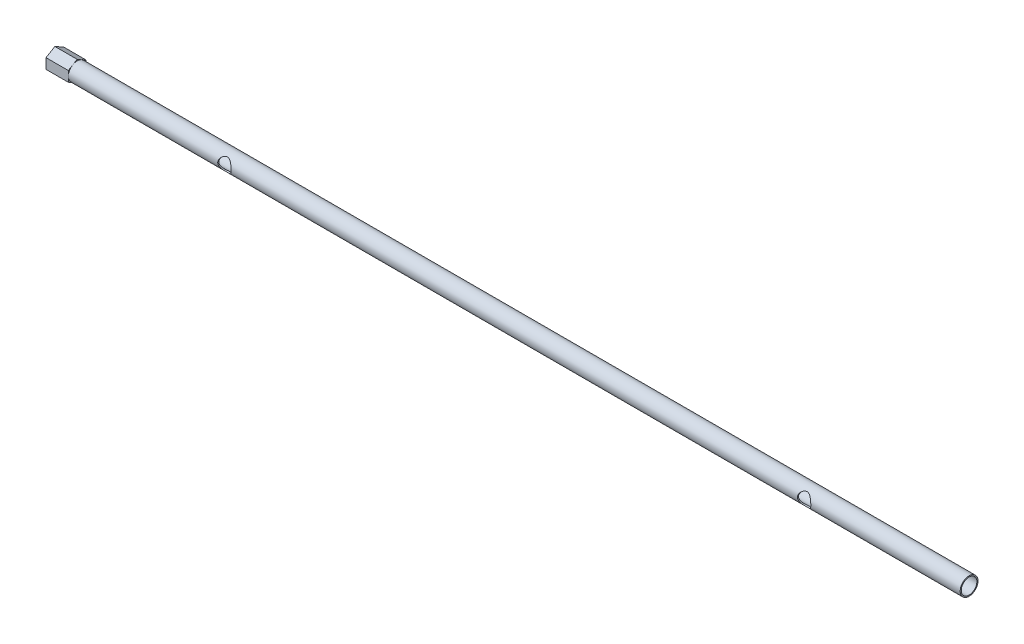
ISO-10303-21;
HEADER;
FILE_DESCRIPTION(('STEP AP214'),'2;1');
FILE_NAME('part.step','',(''),(''),'','','');
FILE_SCHEMA(('AUTOMOTIVE_DESIGN { 1 0 10303 214 1 1 1 1 }'));
ENDSEC;
DATA;
#1=APPLICATION_CONTEXT('core data for automotive mechanical design processes');
#2=APPLICATION_PROTOCOL_DEFINITION('international standard','automotive_design',2000,#1);
#3=PRODUCT_CONTEXT('',#1,'mechanical');
#4=PRODUCT('Part','Part','',(#3));
#5=PRODUCT_RELATED_PRODUCT_CATEGORY('part','',(#4));
#6=PRODUCT_DEFINITION_FORMATION('','',#4);
#7=PRODUCT_DEFINITION_CONTEXT('part definition',#1,'design');
#8=PRODUCT_DEFINITION('design','',#6,#7);
#9=PRODUCT_DEFINITION_SHAPE('','',#8);
#10=(LENGTH_UNIT() NAMED_UNIT(*) SI_UNIT(.MILLI.,.METRE.));
#11=(NAMED_UNIT(*) PLANE_ANGLE_UNIT() SI_UNIT($,.RADIAN.));
#12=(NAMED_UNIT(*) SI_UNIT($,.STERADIAN.) SOLID_ANGLE_UNIT());
#13=UNCERTAINTY_MEASURE_WITH_UNIT(LENGTH_MEASURE(1.E-05),#10,'distance_accuracy_value','');
#14=(GEOMETRIC_REPRESENTATION_CONTEXT(3) GLOBAL_UNCERTAINTY_ASSIGNED_CONTEXT((#13)) GLOBAL_UNIT_ASSIGNED_CONTEXT((#10,
#11,#12)) REPRESENTATION_CONTEXT('',''));
#15=CARTESIAN_POINT('',(0.,0.,0.));
#16=DIRECTION('',(0.,0.,1.));
#17=DIRECTION('',(1.,0.,0.));
#18=AXIS2_PLACEMENT_3D('',#15,#16,#17);
#19=CARTESIAN_POINT('',(100.,0.,0.));
#20=DIRECTION('',(1.,0.,0.));
#21=DIRECTION('',(0.,0.,-1.));
#22=AXIS2_PLACEMENT_3D('',#19,#20,#21);
#23=PLANE('',#22);
#24=CARTESIAN_POINT('',(100.,0.,0.));
#25=DIRECTION('',(1.,0.,0.));
#26=DIRECTION('',(0.,0.,-1.));
#27=AXIS2_PLACEMENT_3D('',#24,#25,#26);
#28=CIRCLE('',#27,1.75);
#29=CARTESIAN_POINT('',(100.,0.,-1.75000000000002));
#30=VERTEX_POINT('',#29);
#31=EDGE_CURVE('E279',#30,#30,#28,.T.);
#32=ORIENTED_EDGE('',*,*,#31,.F.);
#33=EDGE_LOOP('',(#32));
#34=FACE_BOUND('',#33,.T.);
#35=CARTESIAN_POINT('',(100.,0.,0.));
#36=DIRECTION('',(1.,0.,0.));
#37=DIRECTION('',(0.,0.,-1.));
#38=AXIS2_PLACEMENT_3D('',#35,#36,#37);
#39=CIRCLE('',#38,2.);
#40=CARTESIAN_POINT('',(100.,0.,-2.00000000000004));
#41=VERTEX_POINT('',#40);
#42=EDGE_CURVE('E12',#41,#41,#39,.T.);
#43=ORIENTED_EDGE('',*,*,#42,.T.);
#44=EDGE_LOOP('',(#43));
#45=FACE_BOUND('',#44,.T.);
#46=ADVANCED_FACE('F49',(#34,#45),#23,.T.);
#47=CARTESIAN_POINT('',(-100.,0.,0.));
#48=DIRECTION('',(1.,0.,0.));
#49=DIRECTION('',(0.,0.,-1.));
#50=AXIS2_PLACEMENT_3D('',#47,#48,#49);
#51=CYLINDRICAL_SURFACE('',#50,2.);
#52=CARTESIAN_POINT('',(66.5,0.,2.));
#53=CARTESIAN_POINT('',(66.499995207988,0.0732207358411531,1.99999540196398));
#54=CARTESIAN_POINT('',(66.4945949756255,0.146561062021482,1.99593645526273));
#55=CARTESIAN_POINT('',(66.4733329365898,0.290936396286464,1.98006607281078));
#56=CARTESIAN_POINT('',(66.4574448283499,0.361965136229003,1.9682351467985));
#57=CARTESIAN_POINT('',(66.4162870907162,0.49923462663125,1.93795674956057));
#58=CARTESIAN_POINT('',(66.3910744864308,0.565501615403738,1.91954951932006));
#59=CARTESIAN_POINT('',(66.3324576558128,0.692422335520754,1.8775055672169));
#60=CARTESIAN_POINT('',(66.2990558258065,0.753077701796332,1.8538703753548));
#61=CARTESIAN_POINT('',(66.2217369884092,0.873465937590141,1.8004954454398));
#62=CARTESIAN_POINT('',(66.1771326706659,0.932593229272026,1.77039308548437));
#63=CARTESIAN_POINT('',(66.0805041626388,1.0430271676767,1.70767017883375));
#64=CARTESIAN_POINT('',(66.0284685172002,1.09432148272226,1.67504578078606));
#65=CARTESIAN_POINT('',(65.9064170467216,1.19837161436623,1.60271123651987));
#66=CARTESIAN_POINT('',(65.8348963228783,1.24930578421204,1.56290854864636));
#67=CARTESIAN_POINT('',(65.6825489876335,1.33861998176348,1.48711444664132));
#68=CARTESIAN_POINT('',(65.6017353029997,1.37701716983077,1.45111786883673));
#69=CARTESIAN_POINT('',(65.4604971613238,1.42880627811788,1.39977155180176));
#70=CARTESIAN_POINT('',(65.4026093028716,1.44625674456538,1.38157751186731));
#71=CARTESIAN_POINT('',(65.2836072652151,1.47420672564843,1.35171594150683));
#72=CARTESIAN_POINT('',(65.2225008221252,1.48472215355267,1.34003347910829));
#73=CARTESIAN_POINT('',(65.0978174144692,1.49812822141445,1.3250375968455));
#74=CARTESIAN_POINT('',(65.034223193276,1.50094954854207,1.32180026676594));
#75=CARTESIAN_POINT('',(64.9073850891184,1.49848213241868,1.32459531776065));
#76=CARTESIAN_POINT('',(64.8441413399126,1.49319048157349,1.3306310221811));
#77=CARTESIAN_POINT('',(64.7268086525742,1.47597739291882,1.34967623262516));
#78=CARTESIAN_POINT('',(64.6724636289538,1.46482486380817,1.36187157059868));
#79=CARTESIAN_POINT('',(64.5665611212792,1.43705671120733,1.39114192844935));
#80=CARTESIAN_POINT('',(64.5150063721764,1.42043583681173,1.40822163640765));
#81=CARTESIAN_POINT('',(64.3837436133659,1.37033064172535,1.45741769294302));
#82=CARTESIAN_POINT('',(64.3065995833565,1.33280148493981,1.49225649139229));
#83=CARTESIAN_POINT('',(64.1608034761309,1.2461802331452,1.56533298145192));
#84=CARTESIAN_POINT('',(64.0921726607454,1.1970600425588,1.60357878886105));
#85=CARTESIAN_POINT('',(63.9622466095964,1.08651604102137,1.68051672313141));
#86=CARTESIAN_POINT('',(63.9011793931185,1.02481375526039,1.71919586730235));
#87=CARTESIAN_POINT('',(63.7897363532189,0.890422521709622,1.79248037980968));
#88=CARTESIAN_POINT('',(63.7393400797697,0.817755054293794,1.82709348263755));
#89=CARTESIAN_POINT('',(63.6600192007597,0.677902080454187,1.88279726073639));
#90=CARTESIAN_POINT('',(63.6288154057842,0.612539870185665,1.90520770945004));
#91=CARTESIAN_POINT('',(63.5757751195362,0.476352173202131,1.94372904416944));
#92=CARTESIAN_POINT('',(63.5539327615007,0.40553014106381,1.95984387504348));
#93=CARTESIAN_POINT('',(63.5207466371136,0.259676232483561,1.98445588635986));
#94=CARTESIAN_POINT('',(63.5094678210614,0.184621281405985,1.99290592971746));
#95=CARTESIAN_POINT('',(63.4984504026283,0.0332012397969592,2.00115883659442));
#96=CARTESIAN_POINT('',(63.4987069313046,-0.043163284372682,2.00096534845405));
#97=CARTESIAN_POINT('',(63.5101108692732,-0.186804217329586,1.99242547175871));
#98=CARTESIAN_POINT('',(63.5201605368887,-0.254222327546095,1.98490086600399));
#99=CARTESIAN_POINT('',(63.5489737800079,-0.386110670609081,1.96351320201585));
#100=CARTESIAN_POINT('',(63.5677392096894,-0.450580272987225,1.9496487950726));
#101=CARTESIAN_POINT('',(63.6138875305931,-0.577416779689736,1.91599830683311));
#102=CARTESIAN_POINT('',(63.6415511814274,-0.639629172536109,1.89602050290191));
#103=CARTESIAN_POINT('',(63.7041724554256,-0.758518527043045,1.85166985411961));
#104=CARTESIAN_POINT('',(63.7391310876397,-0.815194721336375,1.82729640132066));
#105=CARTESIAN_POINT('',(63.8217832464106,-0.931511626319005,1.77119146886498));
#106=CARTESIAN_POINT('',(63.8706285394374,-0.990066762698668,1.73891095025036));
#107=CARTESIAN_POINT('',(63.9760087525884,-1.0987197485585,1.67238952874784));
#108=CARTESIAN_POINT('',(64.0325606996933,-1.14879830469573,1.63814438507394));
#109=CARTESIAN_POINT('',(64.1641498809611,-1.24877541075623,1.56369128291496));
#110=CARTESIAN_POINT('',(64.2406575614923,-1.29683043648702,1.523587185201));
#111=CARTESIAN_POINT('',(64.4033600779724,-1.3792323599828,1.4494059134845));
#112=CARTESIAN_POINT('',(64.4895251219085,-1.41362000515517,1.41531099570968));
#113=CARTESIAN_POINT('',(64.6354144488744,-1.45615734256766,1.37118877808581));
#114=CARTESIAN_POINT('',(64.6923911264023,-1.46931009512994,1.35695811824563));
#115=CARTESIAN_POINT('',(64.8087070469831,-1.48891522181905,1.33542056103009));
#116=CARTESIAN_POINT('',(64.8680407068022,-1.49538255199239,1.32809821220231));
#117=CARTESIAN_POINT('',(64.9878290798113,-1.50115320209064,1.32157601792206));
#118=CARTESIAN_POINT('',(65.0482879430095,-1.50042015325262,1.32241740684972));
#119=CARTESIAN_POINT('',(65.1680568387521,-1.49176883838219,1.33216448543663));
#120=CARTESIAN_POINT('',(65.2273652878972,-1.48384130024585,1.3410805815748));
#121=CARTESIAN_POINT('',(65.3559145714108,-1.45893841819724,1.36817348797769));
#122=CARTESIAN_POINT('',(65.4244971801327,-1.44036567954113,1.38794705950639));
#123=CARTESIAN_POINT('',(65.5565348488304,-1.39469627266121,1.43382963385405));
#124=CARTESIAN_POINT('',(65.6199764420381,-1.36757807297733,1.45995460146924));
#125=CARTESIAN_POINT('',(65.7625206304863,-1.29498918933646,1.52516477328817));
#126=CARTESIAN_POINT('',(65.8394215827557,-1.24641542065974,1.56560203191098));
#127=CARTESIAN_POINT('',(65.9831260449775,-1.13650718465942,1.64713510181266));
#128=CARTESIAN_POINT('',(66.0499204659448,-1.07516134758583,1.68823146954215));
#129=CARTESIAN_POINT('',(66.1728318422833,-0.939627144937967,1.76728988939786));
#130=CARTESIAN_POINT('',(66.2288563193771,-0.86533716156294,1.80522333711065));
#131=CARTESIAN_POINT('',(66.3272230511453,-0.705159098936293,1.8735728966809));
#132=CARTESIAN_POINT('',(66.3695979745725,-0.619299420401887,1.90400691592953));
#133=CARTESIAN_POINT('',(66.4277994209857,-0.464840290356554,1.94636704624042));
#134=CARTESIAN_POINT('',(66.4477667313761,-0.398553614774835,1.96110322499713));
#135=CARTESIAN_POINT('',(66.4784179026115,-0.262841610392866,1.98383739970233));
#136=CARTESIAN_POINT('',(66.4891276902499,-0.193425623835011,1.99185421210891));
#137=CARTESIAN_POINT('',(66.4966046942143,-0.102963309861976,1.99745471706305));
#138=CARTESIAN_POINT('',(66.4978762774894,-0.0824069459941934,1.99840761432076));
#139=CARTESIAN_POINT('',(66.499574673231,-0.041236889624413,1.99968095423136));
#140=CARTESIAN_POINT('',(66.5000013497074,-0.0206231884284055,2.00000129507252));
#141=CARTESIAN_POINT('',(66.5,0.,2.));
#142=B_SPLINE_CURVE_WITH_KNOTS('',3,(#52,#53,#54,#55,#56,#57,#58,#59,#60,#61,#62,#63,#64,#65,
#66,#67,#68,#69,#70,#71,#72,#73,#74,#75,#76,#77,#78,#79,#80,#81,#82,#83,#84,#85,#86,#87,#88,#89,
#90,#91,#92,#93,#94,#95,#96,#97,#98,#99,#100,#101,#102,#103,#104,#105,#106,#107,#108,#109,#110,
#111,#112,#113,#114,#115,#116,#117,#118,#119,#120,#121,#122,#123,#124,#125,#126,#127,#128,#129,
#130,#131,#132,#133,#134,#135,#136,#137,#138,#139,#140,#141),.UNSPECIFIED.,.T.,.F.,(4,2,2,2,2,2,
2,2,2,2,2,2,2,2,2,2,2,2,2,2,2,2,2,2,2,2,2,2,2,2,2,2,2,2,2,2,2,2,2,2,2,2,2,2,4),(0.,
0.21957178657204,0.439696319423245,0.65849633357339,0.877232398849294,1.11622431317429,
1.35558868405162,1.64360015887451,1.93121574056506,2.11999518529899,2.30833993195288,
2.49837587621255,2.68847994300207,2.85826890162705,3.02822137600637,3.30449331805907,
3.58144192357885,3.86535883938086,4.14872662493685,4.37526505006383,4.60166129643112,
4.82944058166894,5.05712372466609,5.26191187011989,5.46674360185808,5.67880439483675,
5.89089453977537,6.13840382081862,6.38646908985446,6.68168596015939,6.97601595850105,
7.15589161422927,7.33536399114202,7.51574333854736,7.69635548563848,7.91639670960126,
8.13699685139911,8.43412246655758,8.73151372390882,9.03135449492637,9.33047220273152,
9.54195697541617,9.75284752283244,9.81468166878704,9.87652576630964),.UNSPECIFIED.);
#143=CARTESIAN_POINT('',(66.5,0.,2.));
#144=VERTEX_POINT('',#143);
#145=EDGE_CURVE('E271',#144,#144,#142,.T.);
#146=ORIENTED_EDGE('',*,*,#145,.F.);
#147=EDGE_LOOP('',(#146));
#148=FACE_BOUND('',#147,.T.);
#149=CARTESIAN_POINT('',(-63.5,0.,2.));
#150=CARTESIAN_POINT('',(-63.500004792012,0.0732207358411538,1.99999540196396));
#151=CARTESIAN_POINT('',(-63.5054050243745,0.146561062021485,1.99593645526274));
#152=CARTESIAN_POINT('',(-63.5266670634102,0.290936396286466,1.98006607281082));
#153=CARTESIAN_POINT('',(-63.5425551716501,0.361965136229003,1.96823514679853));
#154=CARTESIAN_POINT('',(-63.5837129092838,0.49923462663125,1.9379567495606));
#155=CARTESIAN_POINT('',(-63.6089255135692,0.565501615403739,1.91954951932008));
#156=CARTESIAN_POINT('',(-63.6675423441872,0.692422335520755,1.87750556721693));
#157=CARTESIAN_POINT('',(-63.7009441741935,0.753077701796334,1.85387037535483));
#158=CARTESIAN_POINT('',(-63.7782630115908,0.873465937590145,1.80049544543982));
#159=CARTESIAN_POINT('',(-63.8228673293341,0.932593229272033,1.77039308548439));
#160=CARTESIAN_POINT('',(-63.9194958373611,1.04302716767671,1.70767017883377));
#161=CARTESIAN_POINT('',(-63.9715314827998,1.09432148272226,1.67504578078608));
#162=CARTESIAN_POINT('',(-64.0935829532783,1.19837161436624,1.60271123651989));
#163=CARTESIAN_POINT('',(-64.1651036771217,1.24930578421205,1.56290854864638));
#164=CARTESIAN_POINT('',(-64.3174510123665,1.33861998176349,1.48711444664133));
#165=CARTESIAN_POINT('',(-64.3982646970003,1.37701716983078,1.45111786883673));
#166=CARTESIAN_POINT('',(-64.5395028386762,1.4288062781179,1.39977155180176));
#167=CARTESIAN_POINT('',(-64.5973906971283,1.44625674456541,1.38157751186731));
#168=CARTESIAN_POINT('',(-64.7163927347849,1.47420672564846,1.35171594150683));
#169=CARTESIAN_POINT('',(-64.7774991778747,1.48472215355269,1.34003347910829));
#170=CARTESIAN_POINT('',(-64.9021825855307,1.49812822141448,1.32503759684549));
#171=CARTESIAN_POINT('',(-64.965776806724,1.50094954854209,1.32180026676594));
#172=CARTESIAN_POINT('',(-65.0926149108815,1.49848213241871,1.32459531776064));
#173=CARTESIAN_POINT('',(-65.1558586600874,1.49319048157352,1.33063102218109));
#174=CARTESIAN_POINT('',(-65.2731913474258,1.47597739291885,1.34967623262515));
#175=CARTESIAN_POINT('',(-65.3275363710461,1.4648248638082,1.36187157059866));
#176=CARTESIAN_POINT('',(-65.4334388787208,1.43705671120737,1.39114192844934));
#177=CARTESIAN_POINT('',(-65.4849936278235,1.42043583681177,1.40822163640764));
#178=CARTESIAN_POINT('',(-65.6162563866341,1.37033064172539,1.45741769294301));
#179=CARTESIAN_POINT('',(-65.6934004166435,1.33280148493985,1.49225649139227));
#180=CARTESIAN_POINT('',(-65.839196523869,1.24618023314525,1.56533298145191));
#181=CARTESIAN_POINT('',(-65.9078273392546,1.19706004255885,1.60357878886104));
#182=CARTESIAN_POINT('',(-66.0377533904036,1.08651604102143,1.6805167231314));
#183=CARTESIAN_POINT('',(-66.0988206068814,1.02481375526044,1.71919586730234));
#184=CARTESIAN_POINT('',(-66.2102636467811,0.890422521709677,1.79248037980967));
#185=CARTESIAN_POINT('',(-66.2606599202303,0.81775505429385,1.82709348263755));
#186=CARTESIAN_POINT('',(-66.3399807992403,0.677902080454242,1.88279726073639));
#187=CARTESIAN_POINT('',(-66.3711845942157,0.612539870185719,1.90520770945004));
#188=CARTESIAN_POINT('',(-66.4242248804638,0.476352173202188,1.94372904416945));
#189=CARTESIAN_POINT('',(-66.4460672384993,0.405530141063871,1.95984387504349));
#190=CARTESIAN_POINT('',(-66.4792533628864,0.259676232483624,1.98445588635987));
#191=CARTESIAN_POINT('',(-66.4905321789386,0.184621281406046,1.99290592971748));
#192=CARTESIAN_POINT('',(-66.5015495973717,0.0332012397970168,2.00115883659444));
#193=CARTESIAN_POINT('',(-66.5012930686954,-0.0431632843726258,2.00096534845407));
#194=CARTESIAN_POINT('',(-66.4898891307268,-0.186804217329532,1.99242547175874));
#195=CARTESIAN_POINT('',(-66.4798394631113,-0.254222327546042,1.98490086600402));
#196=CARTESIAN_POINT('',(-66.4510262199921,-0.38611067060903,1.96351320201589));
#197=CARTESIAN_POINT('',(-66.4322607903106,-0.450580272987175,1.94964879507263));
#198=CARTESIAN_POINT('',(-66.3861124694069,-0.577416779689684,1.91599830683315));
#199=CARTESIAN_POINT('',(-66.3584488185726,-0.639629172536053,1.89602050290196));
#200=CARTESIAN_POINT('',(-66.2958275445744,-0.758518527042986,1.85166985411966));
#201=CARTESIAN_POINT('',(-66.2608689123603,-0.815194721336316,1.82729640132071));
#202=CARTESIAN_POINT('',(-66.1782167535895,-0.931511626318951,1.77119146886503));
#203=CARTESIAN_POINT('',(-66.1293714605626,-0.990066762698618,1.73891095025041));
#204=CARTESIAN_POINT('',(-66.0239912474117,-1.09871974855846,1.67238952874789));
#205=CARTESIAN_POINT('',(-65.9674393003067,-1.14879830469569,1.638144385074));
#206=CARTESIAN_POINT('',(-65.8358501190389,-1.24877541075619,1.56369128291502));
#207=CARTESIAN_POINT('',(-65.7593424385078,-1.29683043648697,1.52358718520106));
#208=CARTESIAN_POINT('',(-65.5966399220276,-1.37923235998276,1.44940591348456));
#209=CARTESIAN_POINT('',(-65.5104748780915,-1.41362000515513,1.41531099570975));
#210=CARTESIAN_POINT('',(-65.3645855511256,-1.45615734256762,1.37118877808588));
#211=CARTESIAN_POINT('',(-65.3076088735977,-1.46931009512991,1.35695811824569));
#212=CARTESIAN_POINT('',(-65.1912929530169,-1.48891522181902,1.33542056103015));
#213=CARTESIAN_POINT('',(-65.1319592931978,-1.49538255199236,1.32809821220237));
#214=CARTESIAN_POINT('',(-65.0121709201888,-1.50115320209061,1.32157601792211));
#215=CARTESIAN_POINT('',(-64.9517120569905,-1.50042015325259,1.32241740684978));
#216=CARTESIAN_POINT('',(-64.8319431612479,-1.49176883838217,1.33216448543668));
#217=CARTESIAN_POINT('',(-64.7726347121028,-1.48384130024582,1.34108058157485));
#218=CARTESIAN_POINT('',(-64.6440854285893,-1.45893841819721,1.36817348797774));
#219=CARTESIAN_POINT('',(-64.5755028198673,-1.4403656795411,1.38794705950644));
#220=CARTESIAN_POINT('',(-64.4434651511696,-1.39469627266119,1.43382963385409));
#221=CARTESIAN_POINT('',(-64.3800235579619,-1.3675780729773,1.45995460146928));
#222=CARTESIAN_POINT('',(-64.2374793695138,-1.29498918933645,1.52516477328821));
#223=CARTESIAN_POINT('',(-64.1605784172444,-1.24641542065973,1.56560203191102));
#224=CARTESIAN_POINT('',(-64.0168739550225,-1.13650718465941,1.64713510181269));
#225=CARTESIAN_POINT('',(-63.9500795340552,-1.07516134758582,1.68823146954219));
#226=CARTESIAN_POINT('',(-63.8271681577167,-0.939627144937955,1.76728988939789));
#227=CARTESIAN_POINT('',(-63.7711436806229,-0.86533716156293,1.80522333711068));
#228=CARTESIAN_POINT('',(-63.6727769488547,-0.705159098936286,1.87357289668093));
#229=CARTESIAN_POINT('',(-63.6304020254276,-0.619299420401884,1.90400691592955));
#230=CARTESIAN_POINT('',(-63.5722005790143,-0.464840290356556,1.94636704624045));
#231=CARTESIAN_POINT('',(-63.5522332686239,-0.398553614774837,1.96110322499715));
#232=CARTESIAN_POINT('',(-63.5215820973885,-0.262841610392866,1.98383739970236));
#233=CARTESIAN_POINT('',(-63.5108723097501,-0.19342562383501,1.99185421210892));
#234=CARTESIAN_POINT('',(-63.5033953057857,-0.102963309861974,1.99745471706308));
#235=CARTESIAN_POINT('',(-63.5021237225106,-0.0824069459941915,1.99840761432079));
#236=CARTESIAN_POINT('',(-63.500425326769,-0.0412368896244121,1.99968095423138));
#237=CARTESIAN_POINT('',(-63.4999986502926,-0.0206231884284051,2.00000129507253));
#238=CARTESIAN_POINT('',(-63.5,0.,2.));
#239=B_SPLINE_CURVE_WITH_KNOTS('',3,(#149,#150,#151,#152,#153,#154,#155,#156,#157,#158,#159,
#160,#161,#162,#163,#164,#165,#166,#167,#168,#169,#170,#171,#172,#173,#174,#175,#176,#177,#178,
#179,#180,#181,#182,#183,#184,#185,#186,#187,#188,#189,#190,#191,#192,#193,#194,#195,#196,#197,
#198,#199,#200,#201,#202,#203,#204,#205,#206,#207,#208,#209,#210,#211,#212,#213,#214,#215,#216,
#217,#218,#219,#220,#221,#222,#223,#224,#225,#226,#227,#228,#229,#230,#231,#232,#233,#234,#235,
#236,#237,#238),.UNSPECIFIED.,.T.,.F.,(4,2,2,2,2,2,2,2,2,2,2,2,2,2,2,2,2,2,2,2,2,2,2,2,2,2,2,2,
2,2,2,2,2,2,2,2,2,2,2,2,2,2,2,2,4),(0.,0.219571786572042,0.439696319423244,0.658496333573383,
0.877232398849291,1.11622431317428,1.35558868405161,1.6436001588745,1.93121574056507,
2.11999518529901,2.30833993195289,2.49837587621255,2.68847994300209,2.85826890162705,
3.02822137600637,3.30449331805907,3.58144192357885,3.86535883938086,4.14872662493686,
4.37526505006385,4.60166129643113,4.82944058166895,5.0571237246661,5.26191187011991,
5.46674360185809,5.67880439483676,5.89089453977537,6.13840382081862,6.38646908985446,
6.68168596015939,6.97601595850104,7.15589161422926,7.33536399114202,7.51574333854735,
7.6963554856385,7.91639670960127,8.13699685139913,8.43412246655757,8.73151372390882,
9.03135449492638,9.33047220273151,9.54195697541617,9.75284752283244,9.81468166878703,
9.87652576630963),.UNSPECIFIED.);
#240=CARTESIAN_POINT('',(-63.5,0.,2.));
#241=VERTEX_POINT('',#240);
#242=EDGE_CURVE('E264',#241,#241,#239,.T.);
#243=ORIENTED_EDGE('',*,*,#242,.F.);
#244=EDGE_LOOP('',(#243));
#245=FACE_BOUND('',#244,.T.);
#246=ORIENTED_EDGE('',*,*,#42,.F.);
#247=EDGE_LOOP('',(#246));
#248=FACE_BOUND('',#247,.T.);
#249=CARTESIAN_POINT('',(-100.,0.,0.));
#250=DIRECTION('',(1.,0.,0.));
#251=DIRECTION('',(0.,0.,-1.));
#252=AXIS2_PLACEMENT_3D('',#249,#250,#251);
#253=CIRCLE('',#252,2.);
#254=CARTESIAN_POINT('',(-100.,0.0201471971774126,-1.99989852003691));
#255=VERTEX_POINT('',#254);
#256=CARTESIAN_POINT('',(-100.,1.74203652193158,-0.982501275447766));
#257=VERTEX_POINT('',#256);
#258=EDGE_CURVE('E57',#255,#257,#253,.T.);
#259=ORIENTED_EDGE('',*,*,#258,.T.);
#260=CARTESIAN_POINT('',(-100.,1.72188932475418,1.01739724458916));
#261=VERTEX_POINT('',#260);
#262=EDGE_CURVE('E162',#257,#261,#253,.T.);
#263=ORIENTED_EDGE('',*,*,#262,.T.);
#264=CARTESIAN_POINT('',(-100.,-0.0201471971774125,1.99989852003695));
#265=VERTEX_POINT('',#264);
#266=EDGE_CURVE('E167',#261,#265,#253,.T.);
#267=ORIENTED_EDGE('',*,*,#266,.T.);
#268=CARTESIAN_POINT('',(-100.,-1.7420365219316,0.982501275447775));
#269=VERTEX_POINT('',#268);
#270=EDGE_CURVE('E72',#265,#269,#253,.T.);
#271=ORIENTED_EDGE('',*,*,#270,.T.);
#272=CARTESIAN_POINT('',(-100.,-1.72188932475417,-1.01739724458915));
#273=VERTEX_POINT('',#272);
#274=EDGE_CURVE('E156',#269,#273,#253,.T.);
#275=ORIENTED_EDGE('',*,*,#274,.T.);
#276=EDGE_CURVE('E151',#273,#255,#253,.T.);
#277=ORIENTED_EDGE('',*,*,#276,.T.);
#278=EDGE_LOOP('',(#259,#263,#267,#271,#275,#277));
#279=FACE_BOUND('',#278,.T.);
#280=ADVANCED_FACE('F173',(#148,#245,#248,#279),#51,.T.);
#281=CARTESIAN_POINT('',(-100.,0.,0.));
#282=DIRECTION('',(-1.,0.,0.));
#283=DIRECTION('',(0.,0.,1.));
#284=AXIS2_PLACEMENT_3D('',#281,#282,#283);
#285=PLANE('',#284);
#286=ORIENTED_EDGE('',*,*,#258,.F.);
#287=DIRECTION('',(0.,-0.999949260018464,-0.0100735985887064));
#288=VECTOR('',#287,1.);
#289=CARTESIAN_POINT('',(-100.,1.17478914607267,-1.98826653032311));
#290=LINE('',#289,#288);
#291=CARTESIAN_POINT('',(-100.,1.17478914607267,-1.98826653032311));
#292=VERTEX_POINT('',#291);
#293=EDGE_CURVE('E64',#292,#255,#290,.T.);
#294=ORIENTED_EDGE('',*,*,#293,.F.);
#295=DIRECTION('',(0.,-0.491250637723885,-0.871018260965794));
#296=VECTOR('',#295,1.);
#297=CARTESIAN_POINT('',(-100.,2.30928389779051,0.0232639794276106));
#298=LINE('',#297,#296);
#299=EDGE_CURVE('E200',#257,#292,#298,.T.);
#300=ORIENTED_EDGE('',*,*,#299,.F.);
#301=EDGE_LOOP('',(#286,#294,#300));
#302=FACE_BOUND('',#301,.T.);
#303=ADVANCED_FACE('F233',(#302),#285,.F.);
#304=ORIENTED_EDGE('',*,*,#262,.F.);
#305=CARTESIAN_POINT('',(-100.,2.30928389779051,0.0232639794276106));
#306=VERTEX_POINT('',#305);
#307=EDGE_CURVE('E201',#306,#257,#298,.T.);
#308=ORIENTED_EDGE('',*,*,#307,.F.);
#309=DIRECTION('',(0.,0.508698622294579,-0.860944662377087));
#310=VECTOR('',#309,1.);
#311=CARTESIAN_POINT('',(-100.,1.13449475171784,2.01153050975074));
#312=LINE('',#311,#310);
#313=EDGE_CURVE('E195',#261,#306,#312,.T.);
#314=ORIENTED_EDGE('',*,*,#313,.F.);
#315=EDGE_LOOP('',(#304,#308,#314));
#316=FACE_BOUND('',#315,.T.);
#317=ADVANCED_FACE('F230',(#316),#285,.F.);
#318=ORIENTED_EDGE('',*,*,#266,.F.);
#319=CARTESIAN_POINT('',(-100.,1.13449475171784,2.01153050975074));
#320=VERTEX_POINT('',#319);
#321=EDGE_CURVE('E196',#320,#261,#312,.T.);
#322=ORIENTED_EDGE('',*,*,#321,.F.);
#323=DIRECTION('',(0.,0.999949260018464,0.0100735985887064));
#324=VECTOR('',#323,1.);
#325=CARTESIAN_POINT('',(-100.,-1.17478914607267,1.98826653032315));
#326=LINE('',#325,#324);
#327=EDGE_CURVE('E188',#265,#320,#326,.T.);
#328=ORIENTED_EDGE('',*,*,#327,.F.);
#329=EDGE_LOOP('',(#318,#322,#328));
#330=FACE_BOUND('',#329,.T.);
#331=ADVANCED_FACE('F240',(#330),#285,.F.);
#332=ORIENTED_EDGE('',*,*,#270,.F.);
#333=CARTESIAN_POINT('',(-100.,-1.17478914607267,1.98826653032315));
#334=VERTEX_POINT('',#333);
#335=EDGE_CURVE('E182',#334,#265,#326,.T.);
#336=ORIENTED_EDGE('',*,*,#335,.F.);
#337=DIRECTION('',(0.,0.491250637723885,0.871018260965794));
#338=VECTOR('',#337,1.);
#339=CARTESIAN_POINT('',(-100.,-2.30928389779051,-0.0232639794275722));
#340=LINE('',#339,#338);
#341=EDGE_CURVE('E149',#269,#334,#340,.T.);
#342=ORIENTED_EDGE('',*,*,#341,.F.);
#343=EDGE_LOOP('',(#332,#336,#342));
#344=FACE_BOUND('',#343,.T.);
#345=ADVANCED_FACE('F181',(#344),#285,.F.);
#346=ORIENTED_EDGE('',*,*,#274,.F.);
#347=CARTESIAN_POINT('',(-100.,-2.30928389779051,-0.0232639794275722));
#348=VERTEX_POINT('',#347);
#349=EDGE_CURVE('E178',#348,#269,#340,.T.);
#350=ORIENTED_EDGE('',*,*,#349,.F.);
#351=DIRECTION('',(0.,-0.508698622294579,0.860944662377088));
#352=VECTOR('',#351,1.);
#353=CARTESIAN_POINT('',(-100.,-1.13449475171784,-2.01153050975071));
#354=LINE('',#353,#352);
#355=EDGE_CURVE('E179',#273,#348,#354,.T.);
#356=ORIENTED_EDGE('',*,*,#355,.F.);
#357=EDGE_LOOP('',(#346,#350,#356));
#358=FACE_BOUND('',#357,.T.);
#359=ADVANCED_FACE('F177',(#358),#285,.F.);
#360=CARTESIAN_POINT('',(-105.,-2.30928389779051,-0.0232639794275713));
#361=DIRECTION('',(0.,0.871018260965794,-0.491250637723885));
#362=DIRECTION('',(0.,0.491250637723885,0.871018260965794));
#363=AXIS2_PLACEMENT_3D('',#360,#361,#362);
#364=PLANE('',#363);
#365=ORIENTED_EDGE('',*,*,#349,.T.);
#366=ORIENTED_EDGE('',*,*,#341,.T.);
#367=DIRECTION('',(1.,0.,0.));
#368=VECTOR('',#367,1.);
#369=CARTESIAN_POINT('',(-105.,-1.17478914607267,1.98826653032315));
#370=LINE('',#369,#368);
#371=CARTESIAN_POINT('',(-105.,-1.17478914607267,1.98826653032315));
#372=VERTEX_POINT('',#371);
#373=EDGE_CURVE('E128',#372,#334,#370,.T.);
#374=ORIENTED_EDGE('',*,*,#373,.F.);
#375=DIRECTION('',(0.,0.491250637723885,0.871018260965794));
#376=VECTOR('',#375,1.);
#377=CARTESIAN_POINT('',(-105.,-2.30928389779051,-0.0232639794275713));
#378=LINE('',#377,#376);
#379=CARTESIAN_POINT('',(-105.,-2.30928389779051,-0.0232639794275713));
#380=VERTEX_POINT('',#379);
#381=EDGE_CURVE('E135',#380,#372,#378,.T.);
#382=ORIENTED_EDGE('',*,*,#381,.F.);
#383=DIRECTION('',(1.,0.,0.));
#384=VECTOR('',#383,1.);
#385=CARTESIAN_POINT('',(-105.,-2.30928389779051,-0.0232639794275713));
#386=LINE('',#385,#384);
#387=EDGE_CURVE('E186',#380,#348,#386,.T.);
#388=ORIENTED_EDGE('',*,*,#387,.T.);
#389=EDGE_LOOP('',(#365,#366,#374,#382,#388));
#390=FACE_BOUND('',#389,.T.);
#391=ADVANCED_FACE('F148',(#390),#364,.F.);
#392=CARTESIAN_POINT('',(-105.,-1.17478914607267,1.98826653032315));
#393=DIRECTION('',(0.,0.0100735985887064,-0.999949260018464));
#394=DIRECTION('',(0.,0.999949260018464,0.0100735985887064));
#395=AXIS2_PLACEMENT_3D('',#392,#393,#394);
#396=PLANE('',#395);
#397=ORIENTED_EDGE('',*,*,#335,.T.);
#398=ORIENTED_EDGE('',*,*,#327,.T.);
#399=DIRECTION('',(1.,0.,0.));
#400=VECTOR('',#399,1.);
#401=CARTESIAN_POINT('',(-105.,1.13449475171784,2.01153050975074));
#402=LINE('',#401,#400);
#403=CARTESIAN_POINT('',(-105.,1.13449475171784,2.01153050975074));
#404=VERTEX_POINT('',#403);
#405=EDGE_CURVE('E130',#404,#320,#402,.T.);
#406=ORIENTED_EDGE('',*,*,#405,.F.);
#407=DIRECTION('',(0.,0.999949260018464,0.0100735985887064));
#408=VECTOR('',#407,1.);
#409=CARTESIAN_POINT('',(-105.,-1.17478914607267,1.98826653032315));
#410=LINE('',#409,#408);
#411=EDGE_CURVE('E123',#372,#404,#410,.T.);
#412=ORIENTED_EDGE('',*,*,#411,.F.);
#413=ORIENTED_EDGE('',*,*,#373,.T.);
#414=EDGE_LOOP('',(#397,#398,#406,#412,#413));
#415=FACE_BOUND('',#414,.T.);
#416=ADVANCED_FACE('F126',(#415),#396,.F.);
#417=CARTESIAN_POINT('',(-105.,1.13449475171784,2.01153050975074));
#418=DIRECTION('',(0.,-0.860944662377088,-0.508698622294579));
#419=DIRECTION('',(0.,0.508698622294579,-0.860944662377088));
#420=AXIS2_PLACEMENT_3D('',#417,#418,#419);
#421=PLANE('',#420);
#422=ORIENTED_EDGE('',*,*,#321,.T.);
#423=ORIENTED_EDGE('',*,*,#313,.T.);
#424=DIRECTION('',(1.,0.,0.));
#425=VECTOR('',#424,1.);
#426=CARTESIAN_POINT('',(-105.,2.30928389779051,0.0232639794276115));
#427=LINE('',#426,#425);
#428=CARTESIAN_POINT('',(-105.,2.30928389779051,0.0232639794276115));
#429=VERTEX_POINT('',#428);
#430=EDGE_CURVE('E157',#429,#306,#427,.T.);
#431=ORIENTED_EDGE('',*,*,#430,.F.);
#432=DIRECTION('',(0.,0.508698622294579,-0.860944662377087));
#433=VECTOR('',#432,1.);
#434=CARTESIAN_POINT('',(-105.,1.13449475171784,2.01153050975074));
#435=LINE('',#434,#433);
#436=EDGE_CURVE('E134',#404,#429,#435,.T.);
#437=ORIENTED_EDGE('',*,*,#436,.F.);
#438=ORIENTED_EDGE('',*,*,#405,.T.);
#439=EDGE_LOOP('',(#422,#423,#431,#437,#438));
#440=FACE_BOUND('',#439,.T.);
#441=ADVANCED_FACE('F237',(#440),#421,.F.);
#442=CARTESIAN_POINT('',(-105.,2.30928389779051,0.0232639794276115));
#443=DIRECTION('',(0.,-0.871018260965794,0.491250637723885));
#444=DIRECTION('',(0.,-0.491250637723885,-0.871018260965794));
#445=AXIS2_PLACEMENT_3D('',#442,#443,#444);
#446=PLANE('',#445);
#447=ORIENTED_EDGE('',*,*,#307,.T.);
#448=ORIENTED_EDGE('',*,*,#299,.T.);
#449=DIRECTION('',(1.,0.,0.));
#450=VECTOR('',#449,1.);
#451=CARTESIAN_POINT('',(-105.,1.17478914607267,-1.98826653032311));
#452=LINE('',#451,#450);
#453=CARTESIAN_POINT('',(-105.,1.17478914607267,-1.98826653032311));
#454=VERTEX_POINT('',#453);
#455=EDGE_CURVE('E216',#454,#292,#452,.T.);
#456=ORIENTED_EDGE('',*,*,#455,.F.);
#457=DIRECTION('',(0.,-0.491250637723885,-0.871018260965794));
#458=VECTOR('',#457,1.);
#459=CARTESIAN_POINT('',(-105.,2.30928389779051,0.0232639794276115));
#460=LINE('',#459,#458);
#461=EDGE_CURVE('E226',#429,#454,#460,.T.);
#462=ORIENTED_EDGE('',*,*,#461,.F.);
#463=ORIENTED_EDGE('',*,*,#430,.T.);
#464=EDGE_LOOP('',(#447,#448,#456,#462,#463));
#465=FACE_BOUND('',#464,.T.);
#466=ADVANCED_FACE('F224',(#465),#446,.F.);
#467=CARTESIAN_POINT('',(-105.,1.17478914607267,-1.98826653032311));
#468=DIRECTION('',(0.,-0.0100735985887064,0.999949260018464));
#469=DIRECTION('',(0.,-0.999949260018464,-0.0100735985887064));
#470=AXIS2_PLACEMENT_3D('',#467,#468,#469);
#471=PLANE('',#470);
#472=ORIENTED_EDGE('',*,*,#293,.T.);
#473=CARTESIAN_POINT('',(-100.,-1.13449475171784,-2.01153050975071));
#474=VERTEX_POINT('',#473);
#475=EDGE_CURVE('E205',#255,#474,#290,.T.);
#476=ORIENTED_EDGE('',*,*,#475,.T.);
#477=DIRECTION('',(1.,0.,0.));
#478=VECTOR('',#477,1.);
#479=CARTESIAN_POINT('',(-105.,-1.13449475171784,-2.0115305097507));
#480=LINE('',#479,#478);
#481=CARTESIAN_POINT('',(-105.,-1.13449475171784,-2.0115305097507));
#482=VERTEX_POINT('',#481);
#483=EDGE_CURVE('E212',#482,#474,#480,.T.);
#484=ORIENTED_EDGE('',*,*,#483,.F.);
#485=DIRECTION('',(0.,-0.999949260018464,-0.0100735985887064));
#486=VECTOR('',#485,1.);
#487=CARTESIAN_POINT('',(-105.,1.17478914607267,-1.98826653032311));
#488=LINE('',#487,#486);
#489=EDGE_CURVE('E495',#454,#482,#488,.T.);
#490=ORIENTED_EDGE('',*,*,#489,.F.);
#491=ORIENTED_EDGE('',*,*,#455,.T.);
#492=EDGE_LOOP('',(#472,#476,#484,#490,#491));
#493=FACE_BOUND('',#492,.T.);
#494=ADVANCED_FACE('F320',(#493),#471,.F.);
#495=CARTESIAN_POINT('',(-105.,-1.13449475171784,-2.0115305097507));
#496=DIRECTION('',(0.,0.860944662377088,0.508698622294579));
#497=DIRECTION('',(0.,-0.508698622294579,0.860944662377088));
#498=AXIS2_PLACEMENT_3D('',#495,#496,#497);
#499=PLANE('',#498);
#500=EDGE_CURVE('E145',#474,#273,#354,.T.);
#501=ORIENTED_EDGE('',*,*,#500,.T.);
#502=ORIENTED_EDGE('',*,*,#355,.T.);
#503=ORIENTED_EDGE('',*,*,#387,.F.);
#504=DIRECTION('',(0.,-0.508698622294579,0.860944662377088));
#505=VECTOR('',#504,1.);
#506=CARTESIAN_POINT('',(-105.,-1.13449475171784,-2.0115305097507));
#507=LINE('',#506,#505);
#508=EDGE_CURVE('E140',#482,#380,#507,.T.);
#509=ORIENTED_EDGE('',*,*,#508,.F.);
#510=ORIENTED_EDGE('',*,*,#483,.T.);
#511=EDGE_LOOP('',(#501,#502,#503,#509,#510));
#512=FACE_BOUND('',#511,.T.);
#513=ADVANCED_FACE('F314',(#512),#499,.F.);
#514=CARTESIAN_POINT('',(-105.,0.,0.));
#515=DIRECTION('',(-1.,0.,0.));
#516=DIRECTION('',(0.,0.,1.));
#517=AXIS2_PLACEMENT_3D('',#514,#515,#516);
#518=PLANE('',#517);
#519=ORIENTED_EDGE('',*,*,#381,.T.);
#520=ORIENTED_EDGE('',*,*,#411,.T.);
#521=ORIENTED_EDGE('',*,*,#436,.T.);
#522=ORIENTED_EDGE('',*,*,#461,.T.);
#523=ORIENTED_EDGE('',*,*,#489,.T.);
#524=ORIENTED_EDGE('',*,*,#508,.T.);
#525=EDGE_LOOP('',(#519,#520,#521,#522,#523,#524));
#526=FACE_BOUND('',#525,.T.);
#527=ADVANCED_FACE('F138',(#526),#518,.T.);
#528=ORIENTED_EDGE('',*,*,#276,.F.);
#529=ORIENTED_EDGE('',*,*,#500,.F.);
#530=ORIENTED_EDGE('',*,*,#475,.F.);
#531=EDGE_LOOP('',(#528,#529,#530));
#532=FACE_BOUND('',#531,.T.);
#533=ADVANCED_FACE('F247',(#532),#285,.F.);
#534=CARTESIAN_POINT('',(-100.,0.,0.));
#535=DIRECTION('',(1.,0.,0.));
#536=DIRECTION('',(0.,0.,-1.));
#537=AXIS2_PLACEMENT_3D('',#534,#535,#536);
#538=CYLINDRICAL_SURFACE('',#537,1.75);
#539=CARTESIAN_POINT('',(66.5,0.,1.74999999999999));
#540=CARTESIAN_POINT('',(66.4999956665029,-0.0706294843147711,1.74999575038422));
#541=CARTESIAN_POINT('',(66.4949734408298,-0.14129455107331,1.74568565852737));
#542=CARTESIAN_POINT('',(66.4752601407784,-0.280265050654283,1.72883409707195));
#543=CARTESIAN_POINT('',(66.4605597922691,-0.348568153964802,1.71628473216225));
#544=CARTESIAN_POINT('',(66.4226150183785,-0.480469325937174,1.68411186045575));
#545=CARTESIAN_POINT('',(66.3994235412288,-0.544093678995203,1.6645322068206));
#546=CARTESIAN_POINT('',(66.3457184861563,-0.665945681855859,1.61964268981791));
#547=CARTESIAN_POINT('',(66.3152025152329,-0.724171559274745,1.59433095386288));
#548=CARTESIAN_POINT('',(66.2352375556204,-0.855657019119057,1.52891820346642));
#549=CARTESIAN_POINT('',(66.1829977156402,-0.92624094113972,1.48684933983715));
#550=CARTESIAN_POINT('',(66.0689921749396,-1.05581397859466,1.39784448072112));
#551=CARTESIAN_POINT('',(66.0072009765308,-1.11477106785549,1.35089557100819));
#552=CARTESIAN_POINT('',(65.8739153643866,-1.22219378717171,1.25459785096021));
#553=CARTESIAN_POINT('',(65.8022486550294,-1.27042073904549,1.20521961652676));
#554=CARTESIAN_POINT('',(65.6882229215264,-1.33350052622643,1.13370882338188));
#555=CARTESIAN_POINT('',(65.6491529989851,-1.35297446272818,1.11031171441713));
#556=CARTESIAN_POINT('',(65.5686472907438,-1.3887334821225,1.06524282629204));
#557=CARTESIAN_POINT('',(65.5272134482505,-1.40502113680046,1.04356966411518));
#558=CARTESIAN_POINT('',(65.4393704011343,-1.43500034439099,1.00198158348221));
#559=CARTESIAN_POINT('',(65.392812508803,-1.44849538516497,0.982233143287009));
#560=CARTESIAN_POINT('',(65.296834485985,-1.4711599112826,0.947951547973124));
#561=CARTESIAN_POINT('',(65.2474204459724,-1.48033824537578,0.933407738735024));
#562=CARTESIAN_POINT('',(65.1454506820142,-1.49382592096549,0.911679749827842));
#563=CARTESIAN_POINT('',(65.0928589538138,-1.49806017126875,0.904609223591925));
#564=CARTESIAN_POINT('',(64.9871211145799,-1.50087350699829,0.899939690150751));
#565=CARTESIAN_POINT('',(64.9339756508774,-1.49945858717021,0.902330642657796));
#566=CARTESIAN_POINT('',(64.8374055502362,-1.49182760386887,0.914868450542373));
#567=CARTESIAN_POINT('',(64.7937410303483,-1.48638188421609,0.923768390647751));
#568=CARTESIAN_POINT('',(64.7082944501988,-1.47200134701177,0.946517327724072));
#569=CARTESIAN_POINT('',(64.6665158476665,-1.46306038959269,0.960375030034627));
#570=CARTESIAN_POINT('',(64.5515497501637,-1.43345385551758,1.00442115615035));
#571=CARTESIAN_POINT('',(64.4808647556189,-1.40919923656048,1.03865413339446));
#572=CARTESIAN_POINT('',(64.3460077044997,-1.35191862867246,1.11221273511636));
#573=CARTESIAN_POINT('',(64.2818562702345,-1.31886598815796,1.15155364424071));
#574=CARTESIAN_POINT('',(64.1545339704773,-1.24143800171739,1.23483767308782));
#575=CARTESIAN_POINT('',(64.091862380607,-1.19636292555048,1.27889561911056));
#576=CARTESIAN_POINT('',(63.9736013768306,-1.09657613746107,1.36542479284155));
#577=CARTESIAN_POINT('',(63.9180040067475,-1.04187541928181,1.40789776442771));
#578=CARTESIAN_POINT('',(63.8173526650575,-0.925713669599954,1.48668442914723));
#579=CARTESIAN_POINT('',(63.7719084654896,-0.864732472734047,1.52320068720171));
#580=CARTESIAN_POINT('',(63.6896878410609,-0.734175505287668,1.59023685148791));
#581=CARTESIAN_POINT('',(63.6529031332124,-0.664608045561772,1.62076248319219));
#582=CARTESIAN_POINT('',(63.5955293753356,-0.530831404780991,1.6687836165451));
#583=CARTESIAN_POINT('',(63.5732271194079,-0.467847260702336,1.68762841429908));
#584=CARTESIAN_POINT('',(63.5369988470525,-0.337885976530337,1.71836541513528));
#585=CARTESIAN_POINT('',(63.5230666596121,-0.270911818304046,1.73026274020933));
#586=CARTESIAN_POINT('',(63.5044431030845,-0.134429836405064,1.74618634008914));
#587=CARTESIAN_POINT('',(63.4997941648373,-0.0649118512343672,1.75017647295522));
#588=CARTESIAN_POINT('',(63.5002198251783,0.0740737307051841,1.74981153561202));
#589=CARTESIAN_POINT('',(63.5052940335693,0.143541329384168,1.74545680028863));
#590=CARTESIAN_POINT('',(63.5240609388656,0.275137837653519,1.72941465145713));
#591=CARTESIAN_POINT('',(63.537097707383,0.337432357061996,1.71828550700561));
#592=CARTESIAN_POINT('',(63.5704360357587,0.458582061185514,1.68999280426506));
#593=CARTESIAN_POINT('',(63.5907387402861,0.517436702284635,1.67282829517737));
#594=CARTESIAN_POINT('',(63.6395798235924,0.63533814907738,1.63188561488286));
#595=CARTESIAN_POINT('',(63.668652372267,0.694013833718062,1.60768413152733));
#596=CARTESIAN_POINT('',(63.7330500754124,0.805602730490958,1.55477538177766));
#597=CARTESIAN_POINT('',(63.7683800553391,0.858511444154165,1.52606463999058));
#598=CARTESIAN_POINT('',(63.8634958975598,0.983496331457569,1.45015258150522));
#599=CARTESIAN_POINT('',(63.9266349424147,1.0517987525353,1.40092331861701));
#600=CARTESIAN_POINT('',(64.0629778821521,1.1749350807436,1.29938340654299));
#601=CARTESIAN_POINT('',(64.1362041733576,1.22973823926272,1.2470660529798));
#602=CARTESIAN_POINT('',(64.2744567915788,1.3147542912506,1.1562262832004));
#603=CARTESIAN_POINT('',(64.3375297039108,1.34772459451275,1.11728485114374));
#604=CARTESIAN_POINT('',(64.4700095213249,1.40509893063811,1.0441875153758));
#605=CARTESIAN_POINT('',(64.5393965887317,1.42952869957085,1.01001742391691));
#606=CARTESIAN_POINT('',(64.6568459079476,1.46094623487237,0.963639291395317));
#607=CARTESIAN_POINT('',(64.7027168969795,1.47102282747936,0.948056814342525));
#608=CARTESIAN_POINT('',(64.7967542975185,1.48692763842621,0.922913264550288));
#609=CARTESIAN_POINT('',(64.8449144733254,1.49276676404437,0.913336741132509));
#610=CARTESIAN_POINT('',(64.9430361321333,1.49972970404279,0.901867118731337));
#611=CARTESIAN_POINT('',(64.9930108633822,1.50080548517581,0.900052294403967));
#612=CARTESIAN_POINT('',(65.0924384709339,1.49797733845495,0.904747298240289));
#613=CARTESIAN_POINT('',(65.1418908063035,1.49406867835136,0.911265037390014));
#614=CARTESIAN_POINT('',(65.2479209834266,1.48051295349127,0.933149892403176));
#615=CARTESIAN_POINT('',(65.3040614137058,1.46991450259679,0.949966383483141));
#616=CARTESIAN_POINT('',(65.4126632368585,1.44321198171407,0.990057854832981));
#617=CARTESIAN_POINT('',(65.4651106873311,1.42708826836667,1.01335582159931));
#618=CARTESIAN_POINT('',(65.5580963476868,1.39304037929618,1.05954041623484));
#619=CARTESIAN_POINT('',(65.5991837061124,1.37583613631184,1.0818770565158));
#620=CARTESIAN_POINT('',(65.6790068067083,1.33824363673042,1.12804850687963));
#621=CARTESIAN_POINT('',(65.717741032807,1.31785335702982,1.1518842631013));
#622=CARTESIAN_POINT('',(65.8306996520137,1.25202018613941,1.22441507463449));
#623=CARTESIAN_POINT('',(65.9016365622886,1.20193123895439,1.27411007212106));
#624=CARTESIAN_POINT('',(66.0378804368986,1.08680010401411,1.37385616522881));
#625=CARTESIAN_POINT('',(66.1027472672609,1.02115032813918,1.42380755795178));
#626=CARTESIAN_POINT('',(66.2209622364473,0.876314935759057,1.51721705892391));
#627=CARTESIAN_POINT('',(66.2743423570237,0.797168030962769,1.56069308929431));
#628=CARTESIAN_POINT('',(66.352275580202,0.652581308751093,1.62506440325007));
#629=CARTESIAN_POINT('',(66.3806410529285,0.590449361285756,1.64878766186862));
#630=CARTESIAN_POINT('',(66.4290711242002,0.460986584937162,1.68954763073446));
#631=CARTESIAN_POINT('',(66.4491490967315,0.393664341966798,1.70659511174585));
#632=CARTESIAN_POINT('',(66.4761392335874,0.271894961723886,1.72958115254859));
#633=CARTESIAN_POINT('',(66.485048248842,0.218200596948169,1.73719856665188));
#634=CARTESIAN_POINT('',(66.4969805248469,0.109678028290884,1.74740981982385));
#635=CARTESIAN_POINT('',(66.5000033653255,0.0548497437301037,1.75000330018457));
#636=CARTESIAN_POINT('',(66.5,0.,1.74999999999999));
#637=B_SPLINE_CURVE_WITH_KNOTS('',3,(#539,#540,#541,#542,#543,#544,#545,#546,#547,#548,#549,
#550,#551,#552,#553,#554,#555,#556,#557,#558,#559,#560,#561,#562,#563,#564,#565,#566,#567,#568,
#569,#570,#571,#572,#573,#574,#575,#576,#577,#578,#579,#580,#581,#582,#583,#584,#585,#586,#587,
#588,#589,#590,#591,#592,#593,#594,#595,#596,#597,#598,#599,#600,#601,#602,#603,#604,#605,#606,
#607,#608,#609,#610,#611,#612,#613,#614,#615,#616,#617,#618,#619,#620,#621,#622,#623,#624,#625,
#626,#627,#628,#629,#630,#631,#632,#633,#634,#635,#636),.UNSPECIFIED.,.T.,.F.,(4,2,2,2,2,2,2,2,
2,2,2,2,2,2,2,2,2,2,2,2,2,2,2,2,2,2,2,2,2,2,2,2,2,2,2,2,2,2,2,2,2,2,2,2,2,2,2,2,4),(0.,
0.211654563162927,0.423512241625126,0.634070731141873,0.844698106523179,1.13522422069133,
1.42653974347872,1.72380074181427,1.87224710214081,2.02057314612025,2.17720720527311,
2.3335187679994,2.49217473614345,2.65066238766248,2.78482128935495,2.91921692638903,
3.16441469457679,3.4103638570872,3.67621222623084,3.94175890948155,4.19391844294598,
4.44583579142822,4.65324265064743,4.86049640644472,5.06869530591787,5.27688585038635,
5.46988430717255,5.66291318216236,5.87158857176037,6.08042558891197,6.39448278917421,
6.70924886759075,6.95204361044078,7.19410027741789,7.34209411083035,7.48970564240298,
7.63880233766487,7.78804069140626,7.9657112802606,8.1440201901947,8.29331363525688,
8.44270226842955,8.74163392015878,9.05506901903335,9.36761981248659,9.58371383850301,
9.79945776555019,9.9638136270783,10.1281812231527),.UNSPECIFIED.);
#638=CARTESIAN_POINT('',(66.5,0.,1.74999999999999));
#639=VERTEX_POINT('',#638);
#640=EDGE_CURVE('E292',#639,#639,#637,.T.);
#641=ORIENTED_EDGE('',*,*,#640,.F.);
#642=EDGE_LOOP('',(#641));
#643=FACE_BOUND('',#642,.T.);
#644=CARTESIAN_POINT('',(-63.5,0.,1.75000000000001));
#645=CARTESIAN_POINT('',(-63.5000043334971,-0.070629484314743,1.74999575038425));
#646=CARTESIAN_POINT('',(-63.5050265591702,-0.141294551073281,1.7456856585274));
#647=CARTESIAN_POINT('',(-63.5247398592216,-0.280265050654255,1.72883409707198));
#648=CARTESIAN_POINT('',(-63.5394402077309,-0.348568153964773,1.71628473216228));
#649=CARTESIAN_POINT('',(-63.5773849816215,-0.480469325937143,1.68411186045578));
#650=CARTESIAN_POINT('',(-63.6005764587712,-0.544093678995171,1.66453220682063));
#651=CARTESIAN_POINT('',(-63.6542815138437,-0.665945681855828,1.61964268981795));
#652=CARTESIAN_POINT('',(-63.6847974847671,-0.724171559274716,1.59433095386292));
#653=CARTESIAN_POINT('',(-63.7647624443796,-0.855657019119027,1.52891820346646));
#654=CARTESIAN_POINT('',(-63.8170022843598,-0.926240941139687,1.48684933983719));
#655=CARTESIAN_POINT('',(-63.9310078250604,-1.05581397859463,1.39784448072116));
#656=CARTESIAN_POINT('',(-63.9927990234692,-1.11477106785546,1.35089557100824));
#657=CARTESIAN_POINT('',(-64.1260846356134,-1.22219378717168,1.25459785096026));
#658=CARTESIAN_POINT('',(-64.1977513449706,-1.27042073904546,1.20521961652682));
#659=CARTESIAN_POINT('',(-64.3117770784736,-1.3335005262264,1.13370882338193));
#660=CARTESIAN_POINT('',(-64.3508470010149,-1.35297446272815,1.11031171441719));
#661=CARTESIAN_POINT('',(-64.4313527092562,-1.38873348212247,1.0652428262921));
#662=CARTESIAN_POINT('',(-64.4727865517495,-1.40502113680043,1.04356966411524));
#663=CARTESIAN_POINT('',(-64.5606295988657,-1.43500034439096,1.00198158348228));
#664=CARTESIAN_POINT('',(-64.607187491197,-1.44849538516494,0.982233143287074));
#665=CARTESIAN_POINT('',(-64.703165514015,-1.47115991128258,0.947951547973189));
#666=CARTESIAN_POINT('',(-64.7525795540276,-1.48033824537575,0.93340773873509));
#667=CARTESIAN_POINT('',(-64.8545493179858,-1.49382592096547,0.911679749827909));
#668=CARTESIAN_POINT('',(-64.9071410461862,-1.49806017126873,0.904609223591994));
#669=CARTESIAN_POINT('',(-65.0128788854201,-1.50087350699826,0.899939690150821));
#670=CARTESIAN_POINT('',(-65.0660243491227,-1.49945858717018,0.902330642657868));
#671=CARTESIAN_POINT('',(-65.1625944497638,-1.49182760386884,0.914868450542447));
#672=CARTESIAN_POINT('',(-65.2062589696517,-1.48638188421606,0.923768390647827));
#673=CARTESIAN_POINT('',(-65.2917055498013,-1.47200134701173,0.946517327724151));
#674=CARTESIAN_POINT('',(-65.3334841523335,-1.46306038959265,0.960375030034707));
#675=CARTESIAN_POINT('',(-65.4484502498363,-1.43345385551754,1.00442115615044));
#676=CARTESIAN_POINT('',(-65.5191352443811,-1.40919923656044,1.03865413339454));
#677=CARTESIAN_POINT('',(-65.6539922955004,-1.3519186286724,1.11221273511646));
#678=CARTESIAN_POINT('',(-65.7181437297655,-1.31886598815789,1.1515536442408));
#679=CARTESIAN_POINT('',(-65.8454660295227,-1.24143800171731,1.23483767308792));
#680=CARTESIAN_POINT('',(-65.9081376193931,-1.1963629255504,1.27889561911066));
#681=CARTESIAN_POINT('',(-66.0263986231695,-1.09657613746097,1.36542479284165));
#682=CARTESIAN_POINT('',(-66.0819959932526,-1.04187541928172,1.4078977644278));
#683=CARTESIAN_POINT('',(-66.1826473349426,-0.925713669599849,1.48668442914731));
#684=CARTESIAN_POINT('',(-66.2280915345105,-0.864732472733939,1.5232006872018));
#685=CARTESIAN_POINT('',(-66.3103121589391,-0.734175505287563,1.59023685148798));
#686=CARTESIAN_POINT('',(-66.3470968667876,-0.664608045561673,1.62076248319226));
#687=CARTESIAN_POINT('',(-66.4044706246644,-0.530831404780894,1.66878361654516));
#688=CARTESIAN_POINT('',(-66.4267728805922,-0.467847260702237,1.68762841429913));
#689=CARTESIAN_POINT('',(-66.4630011529475,-0.337885976530235,1.71836541513532));
#690=CARTESIAN_POINT('',(-66.4769333403879,-0.270911818303944,1.73026274020937));
#691=CARTESIAN_POINT('',(-66.4955568969156,-0.134429836404965,1.74618634008917));
#692=CARTESIAN_POINT('',(-66.5002058351627,-0.0649118512342701,1.75017647295524));
#693=CARTESIAN_POINT('',(-66.4997801748217,0.0740737307052758,1.74981153561204));
#694=CARTESIAN_POINT('',(-66.4947059664307,0.143541329384257,1.74545680028865));
#695=CARTESIAN_POINT('',(-66.4759390611344,0.275137837653603,1.72941465145714));
#696=CARTESIAN_POINT('',(-66.462902292617,0.33743235706208,1.71828550700561));
#697=CARTESIAN_POINT('',(-66.4295639642413,0.458582061185596,1.68999280426506));
#698=CARTESIAN_POINT('',(-66.4092612597139,0.517436702284716,1.67282829517737));
#699=CARTESIAN_POINT('',(-66.3604201764076,0.63533814907746,1.63188561488285));
#700=CARTESIAN_POINT('',(-66.331347627733,0.694013833718141,1.60768413152732));
#701=CARTESIAN_POINT('',(-66.2669499245875,0.805602730491036,1.55477538177764));
#702=CARTESIAN_POINT('',(-66.2316199446609,0.858511444154242,1.52606463999056));
#703=CARTESIAN_POINT('',(-66.1365041024402,0.983496331457647,1.45015258150519));
#704=CARTESIAN_POINT('',(-66.0733650575853,1.05179875253538,1.40092331861697));
#705=CARTESIAN_POINT('',(-65.9370221178478,1.17493508074368,1.29938340654294));
#706=CARTESIAN_POINT('',(-65.8637958266423,1.22973823926281,1.24706605297974));
#707=CARTESIAN_POINT('',(-65.7255432084211,1.31475429125068,1.15622628320035));
#708=CARTESIAN_POINT('',(-65.6624702960891,1.34772459451281,1.11728485114369));
#709=CARTESIAN_POINT('',(-65.5299904786751,1.40509893063816,1.04418751537576));
#710=CARTESIAN_POINT('',(-65.4606034112683,1.4295286995709,1.01001742391687));
#711=CARTESIAN_POINT('',(-65.3431540920523,1.4609462348724,0.963639291395286));
#712=CARTESIAN_POINT('',(-65.2972831030204,1.47102282747939,0.948056814342495));
#713=CARTESIAN_POINT('',(-65.2032457024815,1.48692763842624,0.922913264550261));
#714=CARTESIAN_POINT('',(-65.1550855266746,1.4927667640444,0.913336741132483));
#715=CARTESIAN_POINT('',(-65.0569638678667,1.49972970404282,0.901867118731314));
#716=CARTESIAN_POINT('',(-65.0069891366178,1.50080548517584,0.900052294403945));
#717=CARTESIAN_POINT('',(-64.907561529066,1.49797733845498,0.904747298240268));
#718=CARTESIAN_POINT('',(-64.8581091936965,1.49406867835138,0.911265037389995));
#719=CARTESIAN_POINT('',(-64.7520790165734,1.48051295349129,0.933149892403161));
#720=CARTESIAN_POINT('',(-64.6959385862941,1.46991450259682,0.949966383483129));
#721=CARTESIAN_POINT('',(-64.5873367631415,1.44321198171409,0.990057854832976));
#722=CARTESIAN_POINT('',(-64.5348893126688,1.42708826836669,1.01335582159931));
#723=CARTESIAN_POINT('',(-64.4419036523132,1.3930403792962,1.05954041623485));
#724=CARTESIAN_POINT('',(-64.4008162938875,1.37583613631185,1.0818770565158));
#725=CARTESIAN_POINT('',(-64.3209931932917,1.33824363673043,1.12804850687964));
#726=CARTESIAN_POINT('',(-64.2822589671929,1.31785335702983,1.1518842631013));
#727=CARTESIAN_POINT('',(-64.1693003479863,1.25202018613942,1.22441507463451));
#728=CARTESIAN_POINT('',(-64.0983634377114,1.2019312389544,1.27411007212108));
#729=CARTESIAN_POINT('',(-63.9621195631013,1.08680010401411,1.37385616522884));
#730=CARTESIAN_POINT('',(-63.8972527327391,1.02115032813919,1.4238075579518));
#731=CARTESIAN_POINT('',(-63.7790377635527,0.876314935759057,1.51721705892393));
#732=CARTESIAN_POINT('',(-63.7256576429763,0.797168030962763,1.56069308929434));
#733=CARTESIAN_POINT('',(-63.647724419798,0.652581308751087,1.62506440325009));
#734=CARTESIAN_POINT('',(-63.6193589470715,0.590449361285753,1.64878766186864));
#735=CARTESIAN_POINT('',(-63.5709288757998,0.460986584937163,1.68954763073449));
#736=CARTESIAN_POINT('',(-63.5508509032685,0.393664341966798,1.70659511174588));
#737=CARTESIAN_POINT('',(-63.5238607664126,0.271894961723892,1.72958115254861));
#738=CARTESIAN_POINT('',(-63.514951751158,0.218200596948179,1.7371985666519));
#739=CARTESIAN_POINT('',(-63.5030194751531,0.109678028290904,1.74740981982387));
#740=CARTESIAN_POINT('',(-63.4999966346745,0.0548497437301272,1.7500033001846));
#741=CARTESIAN_POINT('',(-63.5,0.,1.75000000000001));
#742=B_SPLINE_CURVE_WITH_KNOTS('',3,(#644,#645,#646,#647,#648,#649,#650,#651,#652,#653,#654,
#655,#656,#657,#658,#659,#660,#661,#662,#663,#664,#665,#666,#667,#668,#669,#670,#671,#672,#673,
#674,#675,#676,#677,#678,#679,#680,#681,#682,#683,#684,#685,#686,#687,#688,#689,#690,#691,#692,
#693,#694,#695,#696,#697,#698,#699,#700,#701,#702,#703,#704,#705,#706,#707,#708,#709,#710,#711,
#712,#713,#714,#715,#716,#717,#718,#719,#720,#721,#722,#723,#724,#725,#726,#727,#728,#729,#730,
#731,#732,#733,#734,#735,#736,#737,#738,#739,#740,#741),.UNSPECIFIED.,.T.,.F.,(4,2,2,2,2,2,2,2,
2,2,2,2,2,2,2,2,2,2,2,2,2,2,2,2,2,2,2,2,2,2,2,2,2,2,2,2,2,2,2,2,2,2,2,2,2,2,2,2,4),(0.,
0.211654563162926,0.423512241625124,0.634070731141866,0.844698106523176,1.13522422069131,
1.42653974347871,1.72380074181425,1.8722471021408,2.02057314612024,2.17720720527309,
2.3335187679994,2.49217473614345,2.65066238766249,2.78482128935498,2.91921692638906,
3.16441469457683,3.41036385708727,3.67621222623092,3.94175890948163,4.19391844294605,
4.44583579142827,4.65324265064748,4.86049640644476,5.06869530591791,5.27688585038638,
5.46988430717257,5.66291318216238,5.8715885717604,6.08042558891201,6.39448278917427,
6.70924886759083,6.95204361044085,7.19410027741792,7.34209411083036,7.48970564240299,
7.63880233766487,7.78804069140626,7.96571128026062,8.14402019019472,8.2933136352569,
8.44270226842958,8.74163392015882,9.05506901903339,9.36761981248663,9.58371383850305,
9.79945776555021,9.96381362707832,10.1281812231527),.UNSPECIFIED.);
#743=CARTESIAN_POINT('',(-63.5,0.,1.75000000000001));
#744=VERTEX_POINT('',#743);
#745=EDGE_CURVE('E298',#744,#744,#742,.T.);
#746=ORIENTED_EDGE('',*,*,#745,.F.);
#747=EDGE_LOOP('',(#746));
#748=FACE_BOUND('',#747,.T.);
#749=CARTESIAN_POINT('',(-100.,0.,0.));
#750=DIRECTION('',(1.,0.,0.));
#751=DIRECTION('',(0.,0.,-1.));
#752=AXIS2_PLACEMENT_3D('',#749,#750,#751);
#753=CIRCLE('',#752,1.75);
#754=CARTESIAN_POINT('',(-100.,0.,-1.74999999999998));
#755=VERTEX_POINT('',#754);
#756=EDGE_CURVE('E184',#755,#755,#753,.T.);
#757=ORIENTED_EDGE('',*,*,#756,.F.);
#758=EDGE_LOOP('',(#757));
#759=FACE_BOUND('',#758,.T.);
#760=ORIENTED_EDGE('',*,*,#31,.T.);
#761=EDGE_LOOP('',(#760));
#762=FACE_BOUND('',#761,.T.);
#763=ADVANCED_FACE('F309',(#643,#748,#759,#762),#538,.F.);
#764=CARTESIAN_POINT('',(-100.,0.,0.));
#765=DIRECTION('',(1.,0.,0.));
#766=DIRECTION('',(0.,0.,-1.));
#767=AXIS2_PLACEMENT_3D('',#764,#765,#766);
#768=PLANE('',#767);
#769=ORIENTED_EDGE('',*,*,#756,.T.);
#770=EDGE_LOOP('',(#769));
#771=FACE_BOUND('',#770,.T.);
#772=ADVANCED_FACE('F306',(#771),#768,.T.);
#773=CARTESIAN_POINT('',(-65.,0.,-2.01253050975071));
#774=DIRECTION('',(0.,0.,1.));
#775=DIRECTION('',(1.,0.,0.));
#776=AXIS2_PLACEMENT_3D('',#773,#774,#775);
#777=CYLINDRICAL_SURFACE('',#776,1.5);
#778=ORIENTED_EDGE('',*,*,#242,.T.);
#779=EDGE_LOOP('',(#778));
#780=FACE_BOUND('',#779,.T.);
#781=ORIENTED_EDGE('',*,*,#745,.T.);
#782=EDGE_LOOP('',(#781));
#783=FACE_BOUND('',#782,.T.);
#784=ADVANCED_FACE('F285',(#780,#783),#777,.F.);
#785=CARTESIAN_POINT('',(65.,0.,-2.01253050975071));
#786=DIRECTION('',(0.,0.,1.));
#787=DIRECTION('',(1.,0.,0.));
#788=AXIS2_PLACEMENT_3D('',#785,#786,#787);
#789=CYLINDRICAL_SURFACE('',#788,1.5);
#790=ORIENTED_EDGE('',*,*,#145,.T.);
#791=EDGE_LOOP('',(#790));
#792=FACE_BOUND('',#791,.T.);
#793=ORIENTED_EDGE('',*,*,#640,.T.);
#794=EDGE_LOOP('',(#793));
#795=FACE_BOUND('',#794,.T.);
#796=ADVANCED_FACE('F281',(#792,#795),#789,.F.);
#797=CLOSED_SHELL('',(#46,#280,#303,#317,#331,#345,#359,#391,#416,#441,#466,#494,#513,#527,#533,
#763,#772,#784,#796));
#798=MANIFOLD_SOLID_BREP('B2',#797);
#799=ADVANCED_BREP_SHAPE_REPRESENTATION('',(#18,#798),#14);
#800=SHAPE_DEFINITION_REPRESENTATION(#9,#799);
ENDSEC;
END-ISO-10303-21;
